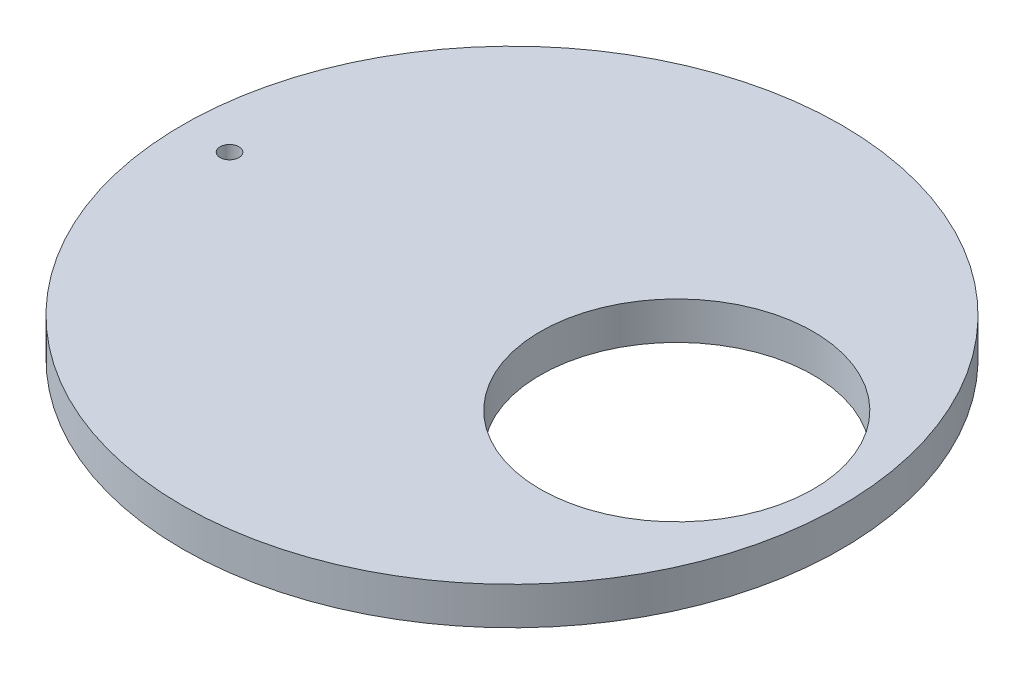
ISO-10303-21;
HEADER;
FILE_DESCRIPTION(('STEP AP214'),'2;1');
FILE_NAME('part.step','',(''),(''),'','','');
FILE_SCHEMA(('AUTOMOTIVE_DESIGN { 1 0 10303 214 1 1 1 1 }'));
ENDSEC;
DATA;
#1=APPLICATION_CONTEXT('core data for automotive mechanical design processes');
#2=APPLICATION_PROTOCOL_DEFINITION('international standard','automotive_design',2000,#1);
#3=PRODUCT_CONTEXT('',#1,'mechanical');
#4=PRODUCT('Part','Part','',(#3));
#5=PRODUCT_RELATED_PRODUCT_CATEGORY('part','',(#4));
#6=PRODUCT_DEFINITION_FORMATION('','',#4);
#7=PRODUCT_DEFINITION_CONTEXT('part definition',#1,'design');
#8=PRODUCT_DEFINITION('design','',#6,#7);
#9=PRODUCT_DEFINITION_SHAPE('','',#8);
#10=(LENGTH_UNIT() NAMED_UNIT(*) SI_UNIT(.MILLI.,.METRE.));
#11=(NAMED_UNIT(*) PLANE_ANGLE_UNIT() SI_UNIT($,.RADIAN.));
#12=(NAMED_UNIT(*) SI_UNIT($,.STERADIAN.) SOLID_ANGLE_UNIT());
#13=UNCERTAINTY_MEASURE_WITH_UNIT(LENGTH_MEASURE(1.E-05),#10,'distance_accuracy_value','');
#14=(GEOMETRIC_REPRESENTATION_CONTEXT(3) GLOBAL_UNCERTAINTY_ASSIGNED_CONTEXT((#13)) GLOBAL_UNIT_ASSIGNED_CONTEXT((#10,
#11,#12)) REPRESENTATION_CONTEXT('',''));
#15=CARTESIAN_POINT('',(0.,0.,0.));
#16=DIRECTION('',(0.,0.,1.));
#17=DIRECTION('',(1.,0.,0.));
#18=AXIS2_PLACEMENT_3D('',#15,#16,#17);
#19=CARTESIAN_POINT('',(-59.9999999814914,-0.001000000000001,0.00149033174099214));
#20=DIRECTION('',(0.,1.,0.));
#21=DIRECTION('',(0.,0.,1.));
#22=AXIS2_PLACEMENT_3D('',#19,#20,#21);
#23=CYLINDRICAL_SURFACE('',#22,2.);
#24=CARTESIAN_POINT('',(-59.9999999814914,7.99999999999999,0.00149033174099214));
#25=DIRECTION('',(0.,1.,0.));
#26=DIRECTION('',(0.,0.,1.));
#27=AXIS2_PLACEMENT_3D('',#24,#25,#26);
#28=CIRCLE('',#27,2.);
#29=CARTESIAN_POINT('',(-59.9999999814914,7.99999999999999,2.001490331741));
#30=VERTEX_POINT('',#29);
#31=EDGE_CURVE('E57',#30,#30,#28,.T.);
#32=ORIENTED_EDGE('',*,*,#31,.T.);
#33=EDGE_LOOP('',(#32));
#34=FACE_BOUND('',#33,.T.);
#35=CARTESIAN_POINT('',(-59.9999999814914,2.,0.00149033174099214));
#36=DIRECTION('',(0.,-1.,0.));
#37=DIRECTION('',(0.,0.,-1.));
#38=AXIS2_PLACEMENT_3D('',#35,#36,#37);
#39=CIRCLE('',#38,2.);
#40=CARTESIAN_POINT('',(-59.9999999814914,2.,-1.99850966825902));
#41=VERTEX_POINT('',#40);
#42=EDGE_CURVE('E38',#41,#41,#39,.F.);
#43=ORIENTED_EDGE('',*,*,#42,.F.);
#44=EDGE_LOOP('',(#43));
#45=FACE_BOUND('',#44,.T.);
#46=ADVANCED_FACE('F34',(#34,#45),#23,.F.);
#47=CARTESIAN_POINT('',(35.0000000000004,7.99999999999999,0.));
#48=DIRECTION('',(0.,-1.,0.));
#49=DIRECTION('',(0.,0.,-1.));
#50=AXIS2_PLACEMENT_3D('',#47,#48,#49);
#51=CYLINDRICAL_SURFACE('',#50,29.);
#52=CARTESIAN_POINT('',(35.0000000000004,7.99999999999999,0.));
#53=DIRECTION('',(0.,1.,0.));
#54=DIRECTION('',(0.,0.,1.));
#55=AXIS2_PLACEMENT_3D('',#52,#53,#54);
#56=CIRCLE('',#55,29.);
#57=CARTESIAN_POINT('',(35.0000000000004,7.99999999999999,29.0000000000001));
#58=VERTEX_POINT('',#57);
#59=EDGE_CURVE('E43',#58,#58,#56,.T.);
#60=ORIENTED_EDGE('',*,*,#59,.T.);
#61=EDGE_LOOP('',(#60));
#62=FACE_BOUND('',#61,.T.);
#63=CARTESIAN_POINT('',(35.0000000000004,0.,0.));
#64=DIRECTION('',(0.,1.,0.));
#65=DIRECTION('',(0.,0.,1.));
#66=AXIS2_PLACEMENT_3D('',#63,#64,#65);
#67=CIRCLE('',#66,29.);
#68=CARTESIAN_POINT('',(35.0000000000004,0.,29.0000000000001));
#69=VERTEX_POINT('',#68);
#70=EDGE_CURVE('E54',#69,#69,#67,.T.);
#71=ORIENTED_EDGE('',*,*,#70,.F.);
#72=EDGE_LOOP('',(#71));
#73=FACE_BOUND('',#72,.T.);
#74=ADVANCED_FACE('F36',(#62,#73),#51,.F.);
#75=CARTESIAN_POINT('',(0.,7.99999999999999,0.));
#76=DIRECTION('',(0.,-1.,0.));
#77=DIRECTION('',(0.,0.,-1.));
#78=AXIS2_PLACEMENT_3D('',#75,#76,#77);
#79=CYLINDRICAL_SURFACE('',#78,70.);
#80=CARTESIAN_POINT('',(0.,7.99999999999999,0.));
#81=DIRECTION('',(0.,1.,0.));
#82=DIRECTION('',(0.,0.,1.));
#83=AXIS2_PLACEMENT_3D('',#80,#81,#82);
#84=CIRCLE('',#83,70.);
#85=CARTESIAN_POINT('',(0.,7.99999999999999,70.0000000000002));
#86=VERTEX_POINT('',#85);
#87=EDGE_CURVE('E10',#86,#86,#84,.T.);
#88=ORIENTED_EDGE('',*,*,#87,.F.);
#89=EDGE_LOOP('',(#88));
#90=FACE_BOUND('',#89,.T.);
#91=CARTESIAN_POINT('',(0.,0.,0.));
#92=DIRECTION('',(0.,1.,0.));
#93=DIRECTION('',(0.,0.,1.));
#94=AXIS2_PLACEMENT_3D('',#91,#92,#93);
#95=CIRCLE('',#94,70.);
#96=CARTESIAN_POINT('',(0.,0.,70.0000000000002));
#97=VERTEX_POINT('',#96);
#98=EDGE_CURVE('E50',#97,#97,#95,.T.);
#99=ORIENTED_EDGE('',*,*,#98,.T.);
#100=EDGE_LOOP('',(#99));
#101=FACE_BOUND('',#100,.T.);
#102=ADVANCED_FACE('F63',(#90,#101),#79,.T.);
#103=CARTESIAN_POINT('',(0.,7.99999999999999,0.));
#104=DIRECTION('',(0.,1.,0.));
#105=DIRECTION('',(0.,0.,1.));
#106=AXIS2_PLACEMENT_3D('',#103,#104,#105);
#107=PLANE('',#106);
#108=ORIENTED_EDGE('',*,*,#31,.F.);
#109=EDGE_LOOP('',(#108));
#110=FACE_BOUND('',#109,.T.);
#111=ORIENTED_EDGE('',*,*,#59,.F.);
#112=EDGE_LOOP('',(#111));
#113=FACE_BOUND('',#112,.T.);
#114=ORIENTED_EDGE('',*,*,#87,.T.);
#115=EDGE_LOOP('',(#114));
#116=FACE_BOUND('',#115,.T.);
#117=ADVANCED_FACE('F68',(#110,#113,#116),#107,.T.);
#118=CARTESIAN_POINT('',(0.,0.,0.));
#119=DIRECTION('',(0.,1.,0.));
#120=DIRECTION('',(0.,0.,1.));
#121=AXIS2_PLACEMENT_3D('',#118,#119,#120);
#122=PLANE('',#121);
#123=CARTESIAN_POINT('',(-59.9999999814914,0.,0.00149033174099214));
#124=DIRECTION('',(0.,-1.,0.));
#125=DIRECTION('',(0.,0.,-1.));
#126=AXIS2_PLACEMENT_3D('',#123,#124,#125);
#127=CIRCLE('',#126,2.4);
#128=CARTESIAN_POINT('',(-59.9999999814914,0.,-2.39850966825902));
#129=VERTEX_POINT('',#128);
#130=EDGE_CURVE('E101',#129,#129,#127,.T.);
#131=ORIENTED_EDGE('',*,*,#130,.F.);
#132=EDGE_LOOP('',(#131));
#133=FACE_BOUND('',#132,.T.);
#134=ORIENTED_EDGE('',*,*,#70,.T.);
#135=EDGE_LOOP('',(#134));
#136=FACE_BOUND('',#135,.T.);
#137=ORIENTED_EDGE('',*,*,#98,.F.);
#138=EDGE_LOOP('',(#137));
#139=FACE_BOUND('',#138,.T.);
#140=ADVANCED_FACE('F65',(#133,#136,#139),#122,.F.);
#141=CARTESIAN_POINT('',(-59.9999999814914,2.,0.00149033174099214));
#142=DIRECTION('',(0.,-1.,0.));
#143=DIRECTION('',(0.,0.,-1.));
#144=AXIS2_PLACEMENT_3D('',#141,#142,#143);
#145=PLANE('',#144);
#146=CARTESIAN_POINT('',(-59.9999999814914,2.,0.00149033174099214));
#147=DIRECTION('',(0.,-1.,0.));
#148=DIRECTION('',(0.,0.,-1.));
#149=AXIS2_PLACEMENT_3D('',#146,#147,#148);
#150=CIRCLE('',#149,2.4);
#151=CARTESIAN_POINT('',(-59.9999999814914,2.,-2.39850966825902));
#152=VERTEX_POINT('',#151);
#153=EDGE_CURVE('E99',#152,#152,#150,.T.);
#154=ORIENTED_EDGE('',*,*,#153,.T.);
#155=EDGE_LOOP('',(#154));
#156=FACE_BOUND('',#155,.T.);
#157=ORIENTED_EDGE('',*,*,#42,.T.);
#158=EDGE_LOOP('',(#157));
#159=FACE_BOUND('',#158,.T.);
#160=ADVANCED_FACE('F67',(#156,#159),#145,.T.);
#161=CARTESIAN_POINT('',(-59.9999999814914,2.,0.00149033174099214));
#162=DIRECTION('',(0.,-1.,0.));
#163=DIRECTION('',(0.,0.,-1.));
#164=AXIS2_PLACEMENT_3D('',#161,#162,#163);
#165=CYLINDRICAL_SURFACE('',#164,2.4);
#166=ORIENTED_EDGE('',*,*,#153,.F.);
#167=EDGE_LOOP('',(#166));
#168=FACE_BOUND('',#167,.T.);
#169=ORIENTED_EDGE('',*,*,#130,.T.);
#170=EDGE_LOOP('',(#169));
#171=FACE_BOUND('',#170,.T.);
#172=ADVANCED_FACE('F75',(#168,#171),#165,.F.);
#173=CLOSED_SHELL('',(#46,#74,#102,#117,#140,#160,#172));
#174=MANIFOLD_SOLID_BREP('B2',#173);
#175=ADVANCED_BREP_SHAPE_REPRESENTATION('',(#18,#174),#14);
#176=SHAPE_DEFINITION_REPRESENTATION(#9,#175);
ENDSEC;
END-ISO-10303-21;
